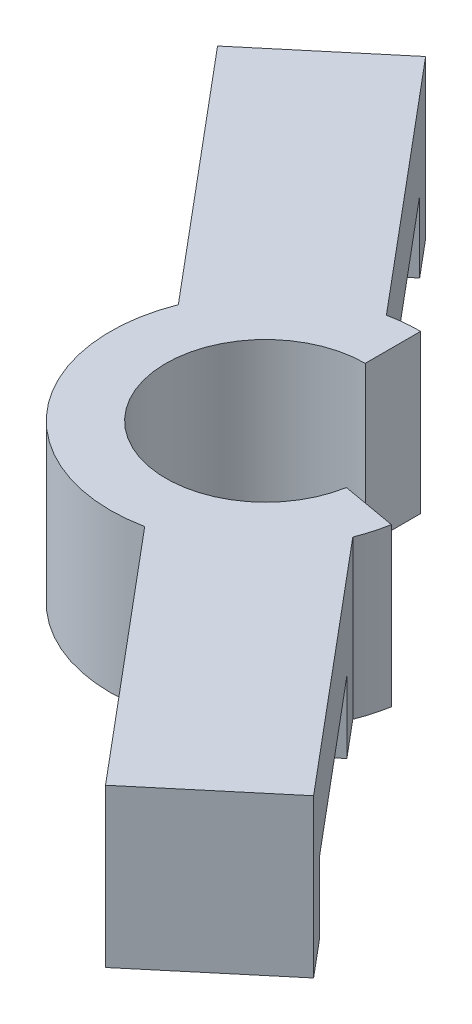
ISO-10303-21;
HEADER;
FILE_DESCRIPTION(('STEP AP214'),'2;1');
FILE_NAME('part.step','',(''),(''),'','','');
FILE_SCHEMA(('AUTOMOTIVE_DESIGN { 1 0 10303 214 1 1 1 1 }'));
ENDSEC;
DATA;
#1=APPLICATION_CONTEXT('core data for automotive mechanical design processes');
#2=APPLICATION_PROTOCOL_DEFINITION('international standard','automotive_design',2000,#1);
#3=PRODUCT_CONTEXT('',#1,'mechanical');
#4=PRODUCT('Part','Part','',(#3));
#5=PRODUCT_RELATED_PRODUCT_CATEGORY('part','',(#4));
#6=PRODUCT_DEFINITION_FORMATION('','',#4);
#7=PRODUCT_DEFINITION_CONTEXT('part definition',#1,'design');
#8=PRODUCT_DEFINITION('design','',#6,#7);
#9=PRODUCT_DEFINITION_SHAPE('','',#8);
#10=(LENGTH_UNIT() NAMED_UNIT(*) SI_UNIT(.MILLI.,.METRE.));
#11=(NAMED_UNIT(*) PLANE_ANGLE_UNIT() SI_UNIT($,.RADIAN.));
#12=(NAMED_UNIT(*) SI_UNIT($,.STERADIAN.) SOLID_ANGLE_UNIT());
#13=UNCERTAINTY_MEASURE_WITH_UNIT(LENGTH_MEASURE(1.E-05),#10,'distance_accuracy_value','');
#14=(GEOMETRIC_REPRESENTATION_CONTEXT(3) GLOBAL_UNCERTAINTY_ASSIGNED_CONTEXT((#13)) GLOBAL_UNIT_ASSIGNED_CONTEXT((#10,
#11,#12)) REPRESENTATION_CONTEXT('',''));
#15=CARTESIAN_POINT('',(0.,0.,0.));
#16=DIRECTION('',(0.,0.,1.));
#17=DIRECTION('',(1.,0.,0.));
#18=AXIS2_PLACEMENT_3D('',#15,#16,#17);
#19=CARTESIAN_POINT('',(0.,0.,0.));
#20=DIRECTION('',(0.,1.,0.));
#21=DIRECTION('',(0.,0.,1.));
#22=AXIS2_PLACEMENT_3D('',#19,#20,#21);
#23=PLANE('',#22);
#24=DIRECTION('',(-0.642787609686538,0.,-0.766044443118979));
#25=VECTOR('',#24,1.);
#26=CARTESIAN_POINT('',(3.06417777247594,0.,-2.57115043874617));
#27=LINE('',#26,#25);
#28=CARTESIAN_POINT('',(-11.0771496406279,0.,-19.4241281873637));
#29=VERTEX_POINT('',#28);
#30=CARTESIAN_POINT('',(-12.7570916906424,0.,-21.4262051608186));
#31=VERTEX_POINT('',#30);
#32=EDGE_CURVE('E315',#29,#31,#27,.T.);
#33=ORIENTED_EDGE('',*,*,#32,.F.);
#34=DIRECTION('',(-0.766044443118979,0.,0.642787609686538));
#35=VECTOR('',#34,1.);
#36=CARTESIAN_POINT('',(-14.1413274131038,0.,-16.8529777486175));
#37=LINE('',#36,#35);
#38=CARTESIAN_POINT('',(-17.2055051855797,0.,-14.2818273098714));
#39=VERTEX_POINT('',#38);
#40=EDGE_CURVE('E11',#29,#39,#37,.T.);
#41=ORIENTED_EDGE('',*,*,#40,.T.);
#42=DIRECTION('',(-0.642787609686538,0.,-0.766044443118979));
#43=VECTOR('',#42,1.);
#44=CARTESIAN_POINT('',(-3.06417777247589,0.,2.57115043874613));
#45=LINE('',#44,#43);
#46=CARTESIAN_POINT('',(-18.8854472355942,0.,-16.2839042833262));
#47=VERTEX_POINT('',#46);
#48=EDGE_CURVE('E206',#39,#47,#45,.T.);
#49=ORIENTED_EDGE('',*,*,#48,.T.);
#50=DIRECTION('',(0.766044443118979,0.,-0.642787609686538));
#51=VECTOR('',#50,1.);
#52=CARTESIAN_POINT('',(-15.8212694631183,0.,-18.8550547220724));
#53=LINE('',#52,#51);
#54=EDGE_CURVE('E212',#47,#31,#53,.T.);
#55=ORIENTED_EDGE('',*,*,#54,.T.);
#56=EDGE_LOOP('',(#33,#41,#49,#55));
#57=FACE_BOUND('',#56,.T.);
#58=ADVANCED_FACE('F44',(#57),#23,.F.);
#59=DIRECTION('',(0.642787609686538,0.,0.766044443118979));
#60=VECTOR('',#59,1.);
#61=CARTESIAN_POINT('',(-3.06417777247589,0.,2.57115043874613));
#62=LINE('',#61,#60);
#63=CARTESIAN_POINT('',(11.0771496406279,0.,19.4241281873637));
#64=VERTEX_POINT('',#63);
#65=CARTESIAN_POINT('',(12.7570916906424,0.,21.4262051608185));
#66=VERTEX_POINT('',#65);
#67=EDGE_CURVE('E210',#64,#66,#62,.T.);
#68=ORIENTED_EDGE('',*,*,#67,.F.);
#69=DIRECTION('',(0.766044443118979,0.,-0.642787609686538));
#70=VECTOR('',#69,1.);
#71=CARTESIAN_POINT('',(14.1413274131038,0.,16.8529777486175));
#72=LINE('',#71,#70);
#73=CARTESIAN_POINT('',(17.2055051855798,0.,14.2818273098714));
#74=VERTEX_POINT('',#73);
#75=EDGE_CURVE('E190',#64,#74,#72,.T.);
#76=ORIENTED_EDGE('',*,*,#75,.T.);
#77=DIRECTION('',(0.642787609686538,0.,0.766044443118979));
#78=VECTOR('',#77,1.);
#79=CARTESIAN_POINT('',(3.06417777247594,0.,-2.57115043874617));
#80=LINE('',#79,#78);
#81=CARTESIAN_POINT('',(18.8854472355942,0.,16.2839042833262));
#82=VERTEX_POINT('',#81);
#83=EDGE_CURVE('E275',#74,#82,#80,.T.);
#84=ORIENTED_EDGE('',*,*,#83,.T.);
#85=DIRECTION('',(0.766044443118979,0.,-0.642787609686538));
#86=VECTOR('',#85,1.);
#87=CARTESIAN_POINT('',(15.8212694631183,0.,18.8550547220724));
#88=LINE('',#87,#86);
#89=EDGE_CURVE('E289',#66,#82,#88,.T.);
#90=ORIENTED_EDGE('',*,*,#89,.F.);
#91=EDGE_LOOP('',(#68,#76,#84,#90));
#92=FACE_BOUND('',#91,.T.);
#93=ADVANCED_FACE('F273',(#92),#23,.F.);
#94=CARTESIAN_POINT('',(15.8212694631183,8.55,18.8550547220724));
#95=DIRECTION('',(-0.642787609686538,0.,-0.766044443118979));
#96=DIRECTION('',(-0.766044443118979,0.,0.642787609686538));
#97=AXIS2_PLACEMENT_3D('',#94,#95,#96);
#98=PLANE('',#97);
#99=ORIENTED_EDGE('',*,*,#89,.T.);
#100=DIRECTION('',(0.,-1.,0.));
#101=VECTOR('',#100,1.);
#102=CARTESIAN_POINT('',(18.8854472355942,8.55,16.2839042833262));
#103=LINE('',#102,#101);
#104=CARTESIAN_POINT('',(18.8854472355942,8.55,16.2839042833262));
#105=VERTEX_POINT('',#104);
#106=EDGE_CURVE('E261',#105,#82,#103,.T.);
#107=ORIENTED_EDGE('',*,*,#106,.F.);
#108=DIRECTION('',(0.766044443118979,0.,-0.642787609686538));
#109=VECTOR('',#108,1.);
#110=CARTESIAN_POINT('',(15.8212694631183,8.55,18.8550547220724));
#111=LINE('',#110,#109);
#112=CARTESIAN_POINT('',(12.7570916906424,8.55,21.4262051608185));
#113=VERTEX_POINT('',#112);
#114=EDGE_CURVE('E220',#113,#105,#111,.T.);
#115=ORIENTED_EDGE('',*,*,#114,.F.);
#116=DIRECTION('',(0.,-1.,0.));
#117=VECTOR('',#116,1.);
#118=CARTESIAN_POINT('',(12.7570916906424,8.55,21.4262051608185));
#119=LINE('',#118,#117);
#120=EDGE_CURVE('E221',#113,#66,#119,.T.);
#121=ORIENTED_EDGE('',*,*,#120,.T.);
#122=EDGE_LOOP('',(#99,#107,#115,#121));
#123=FACE_BOUND('',#122,.T.);
#124=ADVANCED_FACE('F46',(#123),#98,.F.);
#125=CARTESIAN_POINT('',(3.06417777247594,8.55,-2.57115043874617));
#126=DIRECTION('',(0.766044443118979,0.,-0.642787609686538));
#127=DIRECTION('',(-0.642787609686538,0.,-0.766044443118979));
#128=AXIS2_PLACEMENT_3D('',#125,#126,#127);
#129=PLANE('',#128);
#130=DIRECTION('',(0.,-1.,0.));
#131=VECTOR('',#130,1.);
#132=CARTESIAN_POINT('',(17.2055051855798,8.55,14.2818273098714));
#133=LINE('',#132,#131);
#134=CARTESIAN_POINT('',(17.2055051855798,3.87239923594268,14.2818273098714));
#135=VERTEX_POINT('',#134);
#136=EDGE_CURVE('E283',#135,#74,#133,.T.);
#137=ORIENTED_EDGE('',*,*,#136,.F.);
#138=DIRECTION('',(0.642787609686538,0.,0.766044443118979));
#139=VECTOR('',#138,1.);
#140=CARTESIAN_POINT('',(3.06417777247594,3.87239923594268,-2.57115043874617));
#141=LINE('',#140,#139);
#142=CARTESIAN_POINT('',(9.49205386934132,3.87239923594268,5.08929399244362));
#143=VERTEX_POINT('',#142);
#144=EDGE_CURVE('E411',#143,#135,#141,.T.);
#145=ORIENTED_EDGE('',*,*,#144,.F.);
#146=DIRECTION('',(0.,1.,0.));
#147=VECTOR('',#146,1.);
#148=CARTESIAN_POINT('',(9.49205386934132,8.55,5.08929399244362));
#149=LINE('',#148,#147);
#150=CARTESIAN_POINT('',(9.49205386934132,0.,5.08929399244362));
#151=VERTEX_POINT('',#150);
#152=EDGE_CURVE('E410',#151,#143,#149,.T.);
#153=ORIENTED_EDGE('',*,*,#152,.F.);
#154=CARTESIAN_POINT('',(7.81211181932685,0.,3.08721701898879));
#155=VERTEX_POINT('',#154);
#156=EDGE_CURVE('E288',#155,#151,#80,.T.);
#157=ORIENTED_EDGE('',*,*,#156,.F.);
#158=DIRECTION('',(0.,-1.,0.));
#159=VECTOR('',#158,1.);
#160=CARTESIAN_POINT('',(7.81211181932685,8.55,3.08721701898879));
#161=LINE('',#160,#159);
#162=CARTESIAN_POINT('',(7.81211181932685,8.55,3.08721701898879));
#163=VERTEX_POINT('',#162);
#164=EDGE_CURVE('E258',#163,#155,#161,.T.);
#165=ORIENTED_EDGE('',*,*,#164,.F.);
#166=DIRECTION('',(0.642787609686538,0.,0.766044443118979));
#167=VECTOR('',#166,1.);
#168=CARTESIAN_POINT('',(3.06417777247594,8.55,-2.57115043874617));
#169=LINE('',#168,#167);
#170=EDGE_CURVE('E366',#163,#105,#169,.T.);
#171=ORIENTED_EDGE('',*,*,#170,.T.);
#172=ORIENTED_EDGE('',*,*,#106,.T.);
#173=ORIENTED_EDGE('',*,*,#83,.F.);
#174=EDGE_LOOP('',(#137,#145,#153,#157,#165,#171,#172,#173));
#175=FACE_BOUND('',#174,.T.);
#176=ADVANCED_FACE('F281',(#175),#129,.T.);
#177=CARTESIAN_POINT('',(0.,8.55,0.));
#178=DIRECTION('',(0.,-1.,0.));
#179=DIRECTION('',(0.,0.,-1.));
#180=AXIS2_PLACEMENT_3D('',#177,#178,#179);
#181=CYLINDRICAL_SURFACE('',#180,8.4);
#182=CARTESIAN_POINT('',(0.,0.,0.));
#183=DIRECTION('',(0.,1.,0.));
#184=DIRECTION('',(0.,0.,1.));
#185=AXIS2_PLACEMENT_3D('',#182,#183,#184);
#186=CIRCLE('',#185,8.4);
#187=CARTESIAN_POINT('',(8.27238512530255,0.,1.45864469240225));
#188=VERTEX_POINT('',#187);
#189=EDGE_CURVE('E294',#155,#188,#186,.T.);
#190=ORIENTED_EDGE('',*,*,#189,.T.);
#191=DIRECTION('',(0.,-1.,0.));
#192=VECTOR('',#191,1.);
#193=CARTESIAN_POINT('',(8.27238512530255,8.55,1.45864469240225));
#194=LINE('',#193,#192);
#195=CARTESIAN_POINT('',(8.27238512530255,8.55,1.45864469240225));
#196=VERTEX_POINT('',#195);
#197=EDGE_CURVE('E255',#196,#188,#194,.T.);
#198=ORIENTED_EDGE('',*,*,#197,.F.);
#199=CARTESIAN_POINT('',(0.,8.55,0.));
#200=DIRECTION('',(0.,1.,0.));
#201=DIRECTION('',(0.,0.,1.));
#202=AXIS2_PLACEMENT_3D('',#199,#200,#201);
#203=CIRCLE('',#202,8.4);
#204=EDGE_CURVE('E369',#163,#196,#203,.T.);
#205=ORIENTED_EDGE('',*,*,#204,.F.);
#206=ORIENTED_EDGE('',*,*,#164,.T.);
#207=EDGE_LOOP('',(#190,#198,#205,#206));
#208=FACE_BOUND('',#207,.T.);
#209=ADVANCED_FACE('F501',(#208),#181,.T.);
#210=CARTESIAN_POINT('',(0.,8.55,0.));
#211=DIRECTION('',(0.173648177666934,0.,-0.984807753012207));
#212=DIRECTION('',(-0.984807753012207,0.,-0.173648177666934));
#213=AXIS2_PLACEMENT_3D('',#210,#211,#212);
#214=PLANE('',#213);
#215=DIRECTION('',(0.984807753012207,0.,0.173648177666934));
#216=VECTOR('',#215,1.);
#217=CARTESIAN_POINT('',(0.,0.,0.));
#218=LINE('',#217,#216);
#219=CARTESIAN_POINT('',(5.31796186626592,0.,0.937700159401445));
#220=VERTEX_POINT('',#219);
#221=EDGE_CURVE('E302',#220,#188,#218,.T.);
#222=ORIENTED_EDGE('',*,*,#221,.F.);
#223=DIRECTION('',(0.,-1.,0.));
#224=VECTOR('',#223,1.);
#225=CARTESIAN_POINT('',(5.31796186626592,8.55,0.937700159401445));
#226=LINE('',#225,#224);
#227=CARTESIAN_POINT('',(5.31796186626592,8.55,0.937700159401445));
#228=VERTEX_POINT('',#227);
#229=EDGE_CURVE('E252',#228,#220,#226,.T.);
#230=ORIENTED_EDGE('',*,*,#229,.F.);
#231=DIRECTION('',(0.984807753012207,0.,0.173648177666934));
#232=VECTOR('',#231,1.);
#233=CARTESIAN_POINT('',(0.,8.55,0.));
#234=LINE('',#233,#232);
#235=EDGE_CURVE('E376',#228,#196,#234,.T.);
#236=ORIENTED_EDGE('',*,*,#235,.T.);
#237=ORIENTED_EDGE('',*,*,#197,.T.);
#238=EDGE_LOOP('',(#222,#230,#236,#237));
#239=FACE_BOUND('',#238,.T.);
#240=ADVANCED_FACE('F403',(#239),#214,.T.);
#241=CARTESIAN_POINT('',(0.,8.55,0.));
#242=DIRECTION('',(0.,-1.,0.));
#243=DIRECTION('',(0.,0.,-1.));
#244=AXIS2_PLACEMENT_3D('',#241,#242,#243);
#245=CYLINDRICAL_SURFACE('',#244,5.4);
#246=CARTESIAN_POINT('',(0.,0.,0.));
#247=DIRECTION('',(0.,1.,0.));
#248=DIRECTION('',(0.,0.,1.));
#249=AXIS2_PLACEMENT_3D('',#246,#247,#248);
#250=CIRCLE('',#249,5.4);
#251=CARTESIAN_POINT('',(0.,0.,-5.4));
#252=VERTEX_POINT('',#251);
#253=EDGE_CURVE('E306',#252,#220,#250,.T.);
#254=ORIENTED_EDGE('',*,*,#253,.F.);
#255=DIRECTION('',(0.,-1.,0.));
#256=VECTOR('',#255,1.);
#257=CARTESIAN_POINT('',(0.,8.55,-5.4));
#258=LINE('',#257,#256);
#259=CARTESIAN_POINT('',(0.,8.55,-5.4));
#260=VERTEX_POINT('',#259);
#261=EDGE_CURVE('E249',#260,#252,#258,.T.);
#262=ORIENTED_EDGE('',*,*,#261,.F.);
#263=CARTESIAN_POINT('',(0.,8.55,0.));
#264=DIRECTION('',(0.,1.,0.));
#265=DIRECTION('',(0.,0.,1.));
#266=AXIS2_PLACEMENT_3D('',#263,#264,#265);
#267=CIRCLE('',#266,5.4);
#268=EDGE_CURVE('E380',#260,#228,#267,.T.);
#269=ORIENTED_EDGE('',*,*,#268,.T.);
#270=ORIENTED_EDGE('',*,*,#229,.T.);
#271=EDGE_LOOP('',(#254,#262,#269,#270));
#272=FACE_BOUND('',#271,.T.);
#273=ADVANCED_FACE('F399',(#272),#245,.F.);
#274=CARTESIAN_POINT('',(0.,8.55,0.));
#275=DIRECTION('',(-1.,0.,0.));
#276=DIRECTION('',(0.,0.,1.));
#277=AXIS2_PLACEMENT_3D('',#274,#275,#276);
#278=PLANE('',#277);
#279=DIRECTION('',(0.,0.,-1.));
#280=VECTOR('',#279,1.);
#281=CARTESIAN_POINT('',(0.,0.,0.));
#282=LINE('',#281,#280);
#283=CARTESIAN_POINT('',(0.,0.,-8.4));
#284=VERTEX_POINT('',#283);
#285=EDGE_CURVE('E310',#252,#284,#282,.T.);
#286=ORIENTED_EDGE('',*,*,#285,.T.);
#287=DIRECTION('',(0.,-1.,0.));
#288=VECTOR('',#287,1.);
#289=CARTESIAN_POINT('',(0.,8.55,-8.4));
#290=LINE('',#289,#288);
#291=CARTESIAN_POINT('',(0.,8.55,-8.4));
#292=VERTEX_POINT('',#291);
#293=EDGE_CURVE('E245',#292,#284,#290,.T.);
#294=ORIENTED_EDGE('',*,*,#293,.F.);
#295=DIRECTION('',(0.,0.,-1.));
#296=VECTOR('',#295,1.);
#297=CARTESIAN_POINT('',(0.,8.55,0.));
#298=LINE('',#297,#296);
#299=EDGE_CURVE('E384',#260,#292,#298,.T.);
#300=ORIENTED_EDGE('',*,*,#299,.F.);
#301=ORIENTED_EDGE('',*,*,#261,.T.);
#302=EDGE_LOOP('',(#286,#294,#300,#301));
#303=FACE_BOUND('',#302,.T.);
#304=ADVANCED_FACE('F494',(#303),#278,.F.);
#305=CARTESIAN_POINT('',(0.,8.55,0.));
#306=DIRECTION('',(0.,-1.,0.));
#307=DIRECTION('',(0.,0.,-1.));
#308=AXIS2_PLACEMENT_3D('',#305,#306,#307);
#309=CYLINDRICAL_SURFACE('',#308,8.4);
#310=CARTESIAN_POINT('',(0.,0.,0.));
#311=DIRECTION('',(0.,1.,0.));
#312=DIRECTION('',(0.,0.,1.));
#313=AXIS2_PLACEMENT_3D('',#310,#311,#312);
#314=CIRCLE('',#313,8.4);
#315=CARTESIAN_POINT('',(-1.68375627437498,0.,-8.22951789648113));
#316=VERTEX_POINT('',#315);
#317=EDGE_CURVE('E313',#284,#316,#314,.T.);
#318=ORIENTED_EDGE('',*,*,#317,.T.);
#319=DIRECTION('',(0.,-1.,0.));
#320=VECTOR('',#319,1.);
#321=CARTESIAN_POINT('',(-1.68375627437498,8.55,-8.22951789648113));
#322=LINE('',#321,#320);
#323=CARTESIAN_POINT('',(-1.68375627437498,8.55,-8.22951789648113));
#324=VERTEX_POINT('',#323);
#325=EDGE_CURVE('E241',#324,#316,#322,.T.);
#326=ORIENTED_EDGE('',*,*,#325,.F.);
#327=CARTESIAN_POINT('',(0.,8.55,0.));
#328=DIRECTION('',(0.,1.,0.));
#329=DIRECTION('',(0.,0.,1.));
#330=AXIS2_PLACEMENT_3D('',#327,#328,#329);
#331=CIRCLE('',#330,8.4);
#332=EDGE_CURVE('E349',#292,#324,#331,.T.);
#333=ORIENTED_EDGE('',*,*,#332,.F.);
#334=ORIENTED_EDGE('',*,*,#293,.T.);
#335=EDGE_LOOP('',(#318,#326,#333,#334));
#336=FACE_BOUND('',#335,.T.);
#337=ADVANCED_FACE('F393',(#336),#309,.T.);
#338=CARTESIAN_POINT('',(3.06417777247594,8.55,-2.57115043874617));
#339=DIRECTION('',(-0.766044443118979,0.,0.642787609686538));
#340=DIRECTION('',(0.642787609686538,0.,0.766044443118979));
#341=AXIS2_PLACEMENT_3D('',#338,#339,#340);
#342=PLANE('',#341);
#343=DIRECTION('',(-0.642787609686538,0.,-0.766044443118979));
#344=VECTOR('',#343,1.);
#345=CARTESIAN_POINT('',(3.06417777247594,3.87239923594268,-2.57115043874617));
#346=LINE('',#345,#344);
#347=CARTESIAN_POINT('',(-3.36369832438943,3.87239923594268,-10.231594869936));
#348=VERTEX_POINT('',#347);
#349=CARTESIAN_POINT('',(-11.0771496406279,3.87239923594268,-19.4241281873637));
#350=VERTEX_POINT('',#349);
#351=EDGE_CURVE('E295',#348,#350,#346,.T.);
#352=ORIENTED_EDGE('',*,*,#351,.T.);
#353=DIRECTION('',(0.,-1.,0.));
#354=VECTOR('',#353,1.);
#355=CARTESIAN_POINT('',(-11.0771496406279,8.55,-19.4241281873637));
#356=LINE('',#355,#354);
#357=EDGE_CURVE('E329',#350,#29,#356,.T.);
#358=ORIENTED_EDGE('',*,*,#357,.T.);
#359=ORIENTED_EDGE('',*,*,#32,.T.);
#360=DIRECTION('',(0.,-1.,0.));
#361=VECTOR('',#360,1.);
#362=CARTESIAN_POINT('',(-12.7570916906424,8.55,-21.4262051608186));
#363=LINE('',#362,#361);
#364=CARTESIAN_POINT('',(-12.7570916906424,8.55,-21.4262051608186));
#365=VERTEX_POINT('',#364);
#366=EDGE_CURVE('E237',#365,#31,#363,.T.);
#367=ORIENTED_EDGE('',*,*,#366,.F.);
#368=DIRECTION('',(-0.642787609686538,0.,-0.766044443118979));
#369=VECTOR('',#368,1.);
#370=CARTESIAN_POINT('',(3.06417777247594,8.55,-2.57115043874617));
#371=LINE('',#370,#369);
#372=EDGE_CURVE('E342',#324,#365,#371,.T.);
#373=ORIENTED_EDGE('',*,*,#372,.F.);
#374=ORIENTED_EDGE('',*,*,#325,.T.);
#375=CARTESIAN_POINT('',(-3.36369832438943,0.,-10.231594869936));
#376=VERTEX_POINT('',#375);
#377=EDGE_CURVE('E316',#316,#376,#27,.T.);
#378=ORIENTED_EDGE('',*,*,#377,.T.);
#379=DIRECTION('',(0.,1.,0.));
#380=VECTOR('',#379,1.);
#381=CARTESIAN_POINT('',(-3.36369832438943,8.55,-10.231594869936));
#382=LINE('',#381,#380);
#383=EDGE_CURVE('E60',#376,#348,#382,.T.);
#384=ORIENTED_EDGE('',*,*,#383,.T.);
#385=EDGE_LOOP('',(#352,#358,#359,#367,#373,#374,#378,#384));
#386=FACE_BOUND('',#385,.T.);
#387=ADVANCED_FACE('F326',(#386),#342,.F.);
#388=CARTESIAN_POINT('',(-15.8212694631183,8.55,-18.8550547220724));
#389=DIRECTION('',(-0.642787609686538,0.,-0.766044443118979));
#390=DIRECTION('',(-0.766044443118979,0.,0.642787609686538));
#391=AXIS2_PLACEMENT_3D('',#388,#389,#390);
#392=PLANE('',#391);
#393=ORIENTED_EDGE('',*,*,#54,.F.);
#394=DIRECTION('',(0.,-1.,0.));
#395=VECTOR('',#394,1.);
#396=CARTESIAN_POINT('',(-18.8854472355942,8.55,-16.2839042833262));
#397=LINE('',#396,#395);
#398=CARTESIAN_POINT('',(-18.8854472355942,8.55,-16.2839042833262));
#399=VERTEX_POINT('',#398);
#400=EDGE_CURVE('E233',#399,#47,#397,.T.);
#401=ORIENTED_EDGE('',*,*,#400,.F.);
#402=DIRECTION('',(0.766044443118979,0.,-0.642787609686538));
#403=VECTOR('',#402,1.);
#404=CARTESIAN_POINT('',(-15.8212694631183,8.55,-18.8550547220724));
#405=LINE('',#404,#403);
#406=EDGE_CURVE('E335',#399,#365,#405,.T.);
#407=ORIENTED_EDGE('',*,*,#406,.T.);
#408=ORIENTED_EDGE('',*,*,#366,.T.);
#409=EDGE_LOOP('',(#393,#401,#407,#408));
#410=FACE_BOUND('',#409,.T.);
#411=ADVANCED_FACE('F333',(#410),#392,.T.);
#412=CARTESIAN_POINT('',(-3.06417777247589,8.55,2.57115043874613));
#413=DIRECTION('',(-0.766044443118979,0.,0.642787609686538));
#414=DIRECTION('',(0.642787609686538,0.,0.766044443118979));
#415=AXIS2_PLACEMENT_3D('',#412,#413,#414);
#416=PLANE('',#415);
#417=DIRECTION('',(0.,-1.,0.));
#418=VECTOR('',#417,1.);
#419=CARTESIAN_POINT('',(-17.2055051855797,0.,-14.2818273098714));
#420=LINE('',#419,#418);
#421=CARTESIAN_POINT('',(-17.2055051855797,3.87239923594268,-14.2818273098714));
#422=VERTEX_POINT('',#421);
#423=EDGE_CURVE('E435',#422,#39,#420,.T.);
#424=ORIENTED_EDGE('',*,*,#423,.F.);
#425=DIRECTION('',(-0.642787609686538,0.,-0.766044443118979));
#426=VECTOR('',#425,1.);
#427=CARTESIAN_POINT('',(-17.2055051855797,3.87239923594268,-14.2818273098714));
#428=LINE('',#427,#426);
#429=CARTESIAN_POINT('',(-9.49205386934127,3.87239923594268,-5.08929399244366));
#430=VERTEX_POINT('',#429);
#431=EDGE_CURVE('E197',#430,#422,#428,.T.);
#432=ORIENTED_EDGE('',*,*,#431,.F.);
#433=DIRECTION('',(0.,1.,0.));
#434=VECTOR('',#433,1.);
#435=CARTESIAN_POINT('',(-9.49205386934127,3.87239923594268,-5.08929399244366));
#436=LINE('',#435,#434);
#437=CARTESIAN_POINT('',(-9.49205386934127,0.,-5.08929399244366));
#438=VERTEX_POINT('',#437);
#439=EDGE_CURVE('E183',#438,#430,#436,.T.);
#440=ORIENTED_EDGE('',*,*,#439,.F.);
#441=CARTESIAN_POINT('',(-7.81211181932681,0.,-3.08721701898885));
#442=VERTEX_POINT('',#441);
#443=EDGE_CURVE('E195',#442,#438,#45,.T.);
#444=ORIENTED_EDGE('',*,*,#443,.F.);
#445=DIRECTION('',(0.,-1.,0.));
#446=VECTOR('',#445,1.);
#447=CARTESIAN_POINT('',(-7.81211181932681,8.55,-3.08721701898885));
#448=LINE('',#447,#446);
#449=CARTESIAN_POINT('',(-7.81211181932681,8.55,-3.08721701898885));
#450=VERTEX_POINT('',#449);
#451=EDGE_CURVE('E230',#450,#442,#448,.T.);
#452=ORIENTED_EDGE('',*,*,#451,.F.);
#453=DIRECTION('',(-0.642787609686538,0.,-0.766044443118979));
#454=VECTOR('',#453,1.);
#455=CARTESIAN_POINT('',(-3.06417777247589,8.55,2.57115043874613));
#456=LINE('',#455,#454);
#457=EDGE_CURVE('E339',#450,#399,#456,.T.);
#458=ORIENTED_EDGE('',*,*,#457,.T.);
#459=ORIENTED_EDGE('',*,*,#400,.T.);
#460=ORIENTED_EDGE('',*,*,#48,.F.);
#461=EDGE_LOOP('',(#424,#432,#440,#444,#452,#458,#459,#460));
#462=FACE_BOUND('',#461,.T.);
#463=ADVANCED_FACE('F194',(#462),#416,.T.);
#464=CARTESIAN_POINT('',(0.,8.55,0.));
#465=DIRECTION('',(0.,-1.,0.));
#466=DIRECTION('',(0.,0.,-1.));
#467=AXIS2_PLACEMENT_3D('',#464,#465,#466);
#468=CYLINDRICAL_SURFACE('',#467,8.4);
#469=CARTESIAN_POINT('',(0.,0.,0.));
#470=DIRECTION('',(0.,1.,0.));
#471=DIRECTION('',(0.,0.,1.));
#472=AXIS2_PLACEMENT_3D('',#469,#470,#471);
#473=CIRCLE('',#472,8.4);
#474=CARTESIAN_POINT('',(1.68375627437503,0.,8.2295178964811));
#475=VERTEX_POINT('',#474);
#476=EDGE_CURVE('E204',#442,#475,#473,.T.);
#477=ORIENTED_EDGE('',*,*,#476,.T.);
#478=DIRECTION('',(0.,-1.,0.));
#479=VECTOR('',#478,1.);
#480=CARTESIAN_POINT('',(1.68375627437503,8.55,8.2295178964811));
#481=LINE('',#480,#479);
#482=CARTESIAN_POINT('',(1.68375627437503,8.55,8.2295178964811));
#483=VERTEX_POINT('',#482);
#484=EDGE_CURVE('E225',#483,#475,#481,.T.);
#485=ORIENTED_EDGE('',*,*,#484,.F.);
#486=CARTESIAN_POINT('',(0.,8.55,0.));
#487=DIRECTION('',(0.,1.,0.));
#488=DIRECTION('',(0.,0.,1.));
#489=AXIS2_PLACEMENT_3D('',#486,#487,#488);
#490=CIRCLE('',#489,8.4);
#491=EDGE_CURVE('E347',#450,#483,#490,.T.);
#492=ORIENTED_EDGE('',*,*,#491,.F.);
#493=ORIENTED_EDGE('',*,*,#451,.T.);
#494=EDGE_LOOP('',(#477,#485,#492,#493));
#495=FACE_BOUND('',#494,.T.);
#496=ADVANCED_FACE('F479',(#495),#468,.T.);
#497=CARTESIAN_POINT('',(-3.06417777247589,8.55,2.57115043874613));
#498=DIRECTION('',(0.766044443118979,0.,-0.642787609686538));
#499=DIRECTION('',(-0.642787609686538,0.,-0.766044443118979));
#500=AXIS2_PLACEMENT_3D('',#497,#498,#499);
#501=PLANE('',#500);
#502=DIRECTION('',(-0.642787609686538,0.,-0.766044443118979));
#503=VECTOR('',#502,1.);
#504=CARTESIAN_POINT('',(11.0771496406279,3.87239923594268,19.4241281873637));
#505=LINE('',#504,#503);
#506=CARTESIAN_POINT('',(11.0771496406279,3.87239923594268,19.4241281873637));
#507=VERTEX_POINT('',#506);
#508=CARTESIAN_POINT('',(3.36369832438949,3.87239923594268,10.2315948699359));
#509=VERTEX_POINT('',#508);
#510=EDGE_CURVE('E199',#507,#509,#505,.T.);
#511=ORIENTED_EDGE('',*,*,#510,.F.);
#512=DIRECTION('',(0.,1.,0.));
#513=VECTOR('',#512,1.);
#514=CARTESIAN_POINT('',(11.0771496406279,0.,19.4241281873637));
#515=LINE('',#514,#513);
#516=EDGE_CURVE('E443',#64,#507,#515,.T.);
#517=ORIENTED_EDGE('',*,*,#516,.F.);
#518=ORIENTED_EDGE('',*,*,#67,.T.);
#519=ORIENTED_EDGE('',*,*,#120,.F.);
#520=DIRECTION('',(0.642787609686538,0.,0.766044443118979));
#521=VECTOR('',#520,1.);
#522=CARTESIAN_POINT('',(-3.06417777247589,8.55,2.57115043874613));
#523=LINE('',#522,#521);
#524=EDGE_CURVE('E226',#483,#113,#523,.T.);
#525=ORIENTED_EDGE('',*,*,#524,.F.);
#526=ORIENTED_EDGE('',*,*,#484,.T.);
#527=CARTESIAN_POINT('',(3.36369832438949,0.,10.2315948699359));
#528=VERTEX_POINT('',#527);
#529=EDGE_CURVE('E216',#475,#528,#62,.T.);
#530=ORIENTED_EDGE('',*,*,#529,.T.);
#531=DIRECTION('',(0.,-1.,0.));
#532=VECTOR('',#531,1.);
#533=CARTESIAN_POINT('',(3.36369832438949,3.87239923594268,10.2315948699359));
#534=LINE('',#533,#532);
#535=EDGE_CURVE('E68',#509,#528,#534,.T.);
#536=ORIENTED_EDGE('',*,*,#535,.F.);
#537=EDGE_LOOP('',(#511,#517,#518,#519,#525,#526,#530,#536));
#538=FACE_BOUND('',#537,.T.);
#539=ADVANCED_FACE('F363',(#538),#501,.F.);
#540=CARTESIAN_POINT('',(0.,8.55,0.));
#541=DIRECTION('',(0.,1.,0.));
#542=DIRECTION('',(0.,0.,1.));
#543=AXIS2_PLACEMENT_3D('',#540,#541,#542);
#544=PLANE('',#543);
#545=ORIENTED_EDGE('',*,*,#114,.T.);
#546=ORIENTED_EDGE('',*,*,#170,.F.);
#547=ORIENTED_EDGE('',*,*,#204,.T.);
#548=ORIENTED_EDGE('',*,*,#235,.F.);
#549=ORIENTED_EDGE('',*,*,#268,.F.);
#550=ORIENTED_EDGE('',*,*,#299,.T.);
#551=ORIENTED_EDGE('',*,*,#332,.T.);
#552=ORIENTED_EDGE('',*,*,#372,.T.);
#553=ORIENTED_EDGE('',*,*,#406,.F.);
#554=ORIENTED_EDGE('',*,*,#457,.F.);
#555=ORIENTED_EDGE('',*,*,#491,.T.);
#556=ORIENTED_EDGE('',*,*,#524,.T.);
#557=EDGE_LOOP('',(#545,#546,#547,#548,#549,#550,#551,#552,#553,#554,#555,#556));
#558=FACE_BOUND('',#557,.T.);
#559=ADVANCED_FACE('F341',(#558),#544,.T.);
#560=ORIENTED_EDGE('',*,*,#443,.T.);
#561=DIRECTION('',(0.766044443118979,0.,-0.642787609686538));
#562=VECTOR('',#561,1.);
#563=CARTESIAN_POINT('',(-6.42787609686538,0.,-7.66044443118979));
#564=LINE('',#563,#562);
#565=EDGE_CURVE('E53',#438,#376,#564,.T.);
#566=ORIENTED_EDGE('',*,*,#565,.T.);
#567=ORIENTED_EDGE('',*,*,#377,.F.);
#568=ORIENTED_EDGE('',*,*,#317,.F.);
#569=ORIENTED_EDGE('',*,*,#285,.F.);
#570=ORIENTED_EDGE('',*,*,#253,.T.);
#571=ORIENTED_EDGE('',*,*,#221,.T.);
#572=ORIENTED_EDGE('',*,*,#189,.F.);
#573=ORIENTED_EDGE('',*,*,#156,.T.);
#574=DIRECTION('',(-0.766044443118979,0.,0.642787609686538));
#575=VECTOR('',#574,1.);
#576=CARTESIAN_POINT('',(6.42787609686538,0.,7.66044443118979));
#577=LINE('',#576,#575);
#578=EDGE_CURVE('E265',#151,#528,#577,.T.);
#579=ORIENTED_EDGE('',*,*,#578,.T.);
#580=ORIENTED_EDGE('',*,*,#529,.F.);
#581=ORIENTED_EDGE('',*,*,#476,.F.);
#582=EDGE_LOOP('',(#560,#566,#567,#568,#569,#570,#571,#572,#573,#579,#580,#581));
#583=FACE_BOUND('',#582,.T.);
#584=ADVANCED_FACE('F202',(#583),#23,.F.);
#585=CARTESIAN_POINT('',(18.7375940718177,3.87239923594268,12.9962520904983));
#586=DIRECTION('',(0.,1.,0.));
#587=DIRECTION('',(0.,0.,1.));
#588=AXIS2_PLACEMENT_3D('',#585,#586,#587);
#589=PLANE('',#588);
#590=ORIENTED_EDGE('',*,*,#144,.T.);
#591=DIRECTION('',(-0.766044443118979,0.,0.642787609686538));
#592=VECTOR('',#591,1.);
#593=CARTESIAN_POINT('',(18.7375940718177,3.87239923594268,12.9962520904983));
#594=LINE('',#593,#592);
#595=EDGE_CURVE('E444',#135,#507,#594,.T.);
#596=ORIENTED_EDGE('',*,*,#595,.T.);
#597=ORIENTED_EDGE('',*,*,#510,.T.);
#598=DIRECTION('',(-0.766044443118979,0.,0.642787609686538));
#599=VECTOR('',#598,1.);
#600=CARTESIAN_POINT('',(11.0241427555793,3.87239923594268,3.80371877307054));
#601=LINE('',#600,#599);
#602=EDGE_CURVE('E440',#143,#509,#601,.T.);
#603=ORIENTED_EDGE('',*,*,#602,.F.);
#604=EDGE_LOOP('',(#590,#596,#597,#603));
#605=FACE_BOUND('',#604,.T.);
#606=ADVANCED_FACE('F451',(#605),#589,.F.);
#607=CARTESIAN_POINT('',(18.7375940718177,0.,12.9962520904983));
#608=DIRECTION('',(0.642787609686538,0.,0.766044443118979));
#609=DIRECTION('',(0.766044443118979,0.,-0.642787609686538));
#610=AXIS2_PLACEMENT_3D('',#607,#608,#609);
#611=PLANE('',#610);
#612=ORIENTED_EDGE('',*,*,#136,.T.);
#613=ORIENTED_EDGE('',*,*,#75,.F.);
#614=ORIENTED_EDGE('',*,*,#516,.T.);
#615=ORIENTED_EDGE('',*,*,#595,.F.);
#616=EDGE_LOOP('',(#612,#613,#614,#615));
#617=FACE_BOUND('',#616,.T.);
#618=ADVANCED_FACE('F454',(#617),#611,.F.);
#619=CARTESIAN_POINT('',(11.0241427555793,3.87239923594268,3.80371877307054));
#620=DIRECTION('',(-0.642787609686538,0.,-0.766044443118979));
#621=DIRECTION('',(-0.766044443118979,0.,0.642787609686538));
#622=AXIS2_PLACEMENT_3D('',#619,#620,#621);
#623=PLANE('',#622);
#624=ORIENTED_EDGE('',*,*,#152,.T.);
#625=ORIENTED_EDGE('',*,*,#602,.T.);
#626=ORIENTED_EDGE('',*,*,#535,.T.);
#627=ORIENTED_EDGE('',*,*,#578,.F.);
#628=EDGE_LOOP('',(#624,#625,#626,#627));
#629=FACE_BOUND('',#628,.T.);
#630=ADVANCED_FACE('F452',(#629),#623,.F.);
#631=CARTESIAN_POINT('',(-9.54506075438993,3.87239923594268,-20.7097034067368));
#632=DIRECTION('',(0.,1.,0.));
#633=DIRECTION('',(0.,0.,1.));
#634=AXIS2_PLACEMENT_3D('',#631,#632,#633);
#635=PLANE('',#634);
#636=DIRECTION('',(-0.766044443118979,0.,0.642787609686538));
#637=VECTOR('',#636,1.);
#638=CARTESIAN_POINT('',(-1.83160943815147,3.87239923594268,-11.517170089309));
#639=LINE('',#638,#637);
#640=EDGE_CURVE('E419',#348,#430,#639,.T.);
#641=ORIENTED_EDGE('',*,*,#640,.T.);
#642=ORIENTED_EDGE('',*,*,#431,.T.);
#643=DIRECTION('',(-0.766044443118979,0.,0.642787609686538));
#644=VECTOR('',#643,1.);
#645=CARTESIAN_POINT('',(-9.54506075438993,3.87239923594268,-20.7097034067368));
#646=LINE('',#645,#644);
#647=EDGE_CURVE('E414',#350,#422,#646,.T.);
#648=ORIENTED_EDGE('',*,*,#647,.F.);
#649=ORIENTED_EDGE('',*,*,#351,.F.);
#650=EDGE_LOOP('',(#641,#642,#648,#649));
#651=FACE_BOUND('',#650,.T.);
#652=ADVANCED_FACE('F433',(#651),#635,.F.);
#653=CARTESIAN_POINT('',(-9.54506075438993,0.,-20.7097034067368));
#654=DIRECTION('',(-0.642787609686538,0.,-0.766044443118979));
#655=DIRECTION('',(-0.766044443118979,0.,0.642787609686538));
#656=AXIS2_PLACEMENT_3D('',#653,#654,#655);
#657=PLANE('',#656);
#658=ORIENTED_EDGE('',*,*,#647,.T.);
#659=ORIENTED_EDGE('',*,*,#423,.T.);
#660=ORIENTED_EDGE('',*,*,#40,.F.);
#661=ORIENTED_EDGE('',*,*,#357,.F.);
#662=EDGE_LOOP('',(#658,#659,#660,#661));
#663=FACE_BOUND('',#662,.T.);
#664=ADVANCED_FACE('F460',(#663),#657,.F.);
#665=CARTESIAN_POINT('',(-1.83160943815147,3.87239923594268,-11.517170089309));
#666=DIRECTION('',(0.642787609686538,0.,0.766044443118979));
#667=DIRECTION('',(0.766044443118979,0.,-0.642787609686538));
#668=AXIS2_PLACEMENT_3D('',#665,#666,#667);
#669=PLANE('',#668);
#670=ORIENTED_EDGE('',*,*,#565,.F.);
#671=ORIENTED_EDGE('',*,*,#439,.T.);
#672=ORIENTED_EDGE('',*,*,#640,.F.);
#673=ORIENTED_EDGE('',*,*,#383,.F.);
#674=EDGE_LOOP('',(#670,#671,#672,#673));
#675=FACE_BOUND('',#674,.T.);
#676=ADVANCED_FACE('F182',(#675),#669,.F.);
#677=CLOSED_SHELL('',(#58,#93,#124,#176,#209,#240,#273,#304,#337,#387,#411,#463,#496,#539,#559,
#584,#606,#618,#630,#652,#664,#676));
#678=MANIFOLD_SOLID_BREP('B2',#677);
#679=ADVANCED_BREP_SHAPE_REPRESENTATION('',(#18,#678),#14);
#680=SHAPE_DEFINITION_REPRESENTATION(#9,#679);
ENDSEC;
END-ISO-10303-21;
